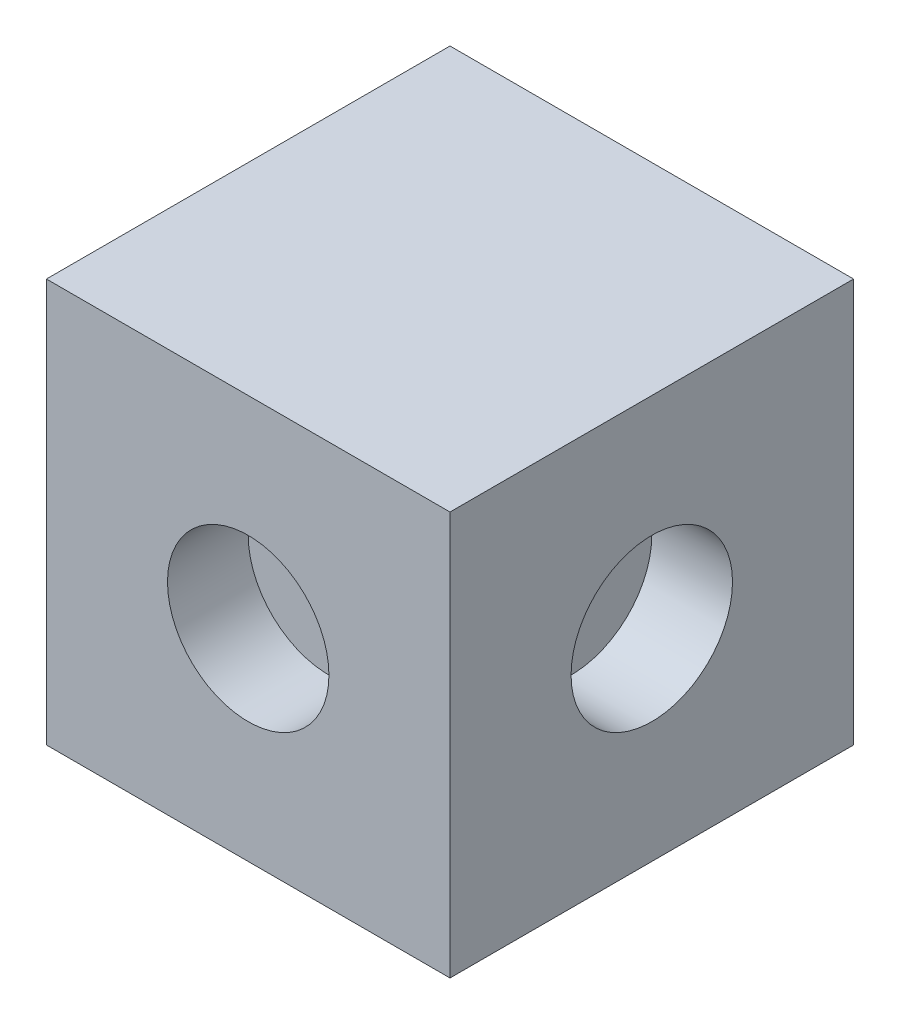
ISO-10303-21;
HEADER;
FILE_DESCRIPTION(('STEP AP214'),'2;1');
FILE_NAME('part.step','',(''),(''),'','','');
FILE_SCHEMA(('AUTOMOTIVE_DESIGN { 1 0 10303 214 1 1 1 1 }'));
ENDSEC;
DATA;
#1=APPLICATION_CONTEXT('core data for automotive mechanical design processes');
#2=APPLICATION_PROTOCOL_DEFINITION('international standard','automotive_design',2000,#1);
#3=PRODUCT_CONTEXT('',#1,'mechanical');
#4=PRODUCT('Part','Part','',(#3));
#5=PRODUCT_RELATED_PRODUCT_CATEGORY('part','',(#4));
#6=PRODUCT_DEFINITION_FORMATION('','',#4);
#7=PRODUCT_DEFINITION_CONTEXT('part definition',#1,'design');
#8=PRODUCT_DEFINITION('design','',#6,#7);
#9=PRODUCT_DEFINITION_SHAPE('','',#8);
#10=(LENGTH_UNIT() NAMED_UNIT(*) SI_UNIT(.MILLI.,.METRE.));
#11=(NAMED_UNIT(*) PLANE_ANGLE_UNIT() SI_UNIT($,.RADIAN.));
#12=(NAMED_UNIT(*) SI_UNIT($,.STERADIAN.) SOLID_ANGLE_UNIT());
#13=UNCERTAINTY_MEASURE_WITH_UNIT(LENGTH_MEASURE(1.E-05),#10,'distance_accuracy_value','');
#14=(GEOMETRIC_REPRESENTATION_CONTEXT(3) GLOBAL_UNCERTAINTY_ASSIGNED_CONTEXT((#13)) GLOBAL_UNIT_ASSIGNED_CONTEXT((#10,
#11,#12)) REPRESENTATION_CONTEXT('',''));
#15=CARTESIAN_POINT('',(0.,0.,0.));
#16=DIRECTION('',(0.,0.,1.));
#17=DIRECTION('',(1.,0.,0.));
#18=AXIS2_PLACEMENT_3D('',#15,#16,#17);
#19=CARTESIAN_POINT('',(25.,-25.,-25.));
#20=DIRECTION('',(0.,0.,1.));
#21=DIRECTION('',(1.,0.,0.));
#22=AXIS2_PLACEMENT_3D('',#19,#20,#21);
#23=PLANE('',#22);
#24=DIRECTION('',(0.,1.,0.));
#25=VECTOR('',#24,1.);
#26=CARTESIAN_POINT('',(-25.,-25.,-25.));
#27=LINE('',#26,#25);
#28=CARTESIAN_POINT('',(-25.,-25.,-25.));
#29=VERTEX_POINT('',#28);
#30=CARTESIAN_POINT('',(-25.,25.,-25.));
#31=VERTEX_POINT('',#30);
#32=EDGE_CURVE('E96',#29,#31,#27,.T.);
#33=ORIENTED_EDGE('',*,*,#32,.T.);
#34=DIRECTION('',(-1.,0.,0.));
#35=VECTOR('',#34,1.);
#36=CARTESIAN_POINT('',(25.,25.,-25.));
#37=LINE('',#36,#35);
#38=CARTESIAN_POINT('',(25.,25.,-25.));
#39=VERTEX_POINT('',#38);
#40=EDGE_CURVE('E11',#39,#31,#37,.T.);
#41=ORIENTED_EDGE('',*,*,#40,.F.);
#42=DIRECTION('',(0.,1.,0.));
#43=VECTOR('',#42,1.);
#44=CARTESIAN_POINT('',(25.,-25.,-25.));
#45=LINE('',#44,#43);
#46=CARTESIAN_POINT('',(25.,-25.,-25.));
#47=VERTEX_POINT('',#46);
#48=EDGE_CURVE('E84',#47,#39,#45,.T.);
#49=ORIENTED_EDGE('',*,*,#48,.F.);
#50=DIRECTION('',(-1.,0.,0.));
#51=VECTOR('',#50,1.);
#52=CARTESIAN_POINT('',(25.,-25.,-25.));
#53=LINE('',#52,#51);
#54=EDGE_CURVE('E92',#47,#29,#53,.T.);
#55=ORIENTED_EDGE('',*,*,#54,.T.);
#56=EDGE_LOOP('',(#33,#41,#49,#55));
#57=FACE_BOUND('',#56,.T.);
#58=CARTESIAN_POINT('',(0.,0.,-25.));
#59=DIRECTION('',(0.,0.,1.));
#60=DIRECTION('',(1.,0.,0.));
#61=AXIS2_PLACEMENT_3D('',#58,#59,#60);
#62=CIRCLE('',#61,10.);
#63=CARTESIAN_POINT('',(10.,0.,-25.));
#64=VERTEX_POINT('',#63);
#65=EDGE_CURVE('E130',#64,#64,#62,.T.);
#66=ORIENTED_EDGE('',*,*,#65,.T.);
#67=EDGE_LOOP('',(#66));
#68=FACE_BOUND('',#67,.T.);
#69=ADVANCED_FACE('F33',(#57,#68),#23,.F.);
#70=CARTESIAN_POINT('',(-25.,0.,0.));
#71=DIRECTION('',(-1.,0.,0.));
#72=DIRECTION('',(0.,0.,1.));
#73=AXIS2_PLACEMENT_3D('',#70,#71,#72);
#74=PLANE('',#73);
#75=ORIENTED_EDGE('',*,*,#32,.F.);
#76=DIRECTION('',(0.,0.,-1.));
#77=VECTOR('',#76,1.);
#78=CARTESIAN_POINT('',(-25.,-25.,25.));
#79=LINE('',#78,#77);
#80=CARTESIAN_POINT('',(-25.,-25.,25.));
#81=VERTEX_POINT('',#80);
#82=EDGE_CURVE('E72',#81,#29,#79,.T.);
#83=ORIENTED_EDGE('',*,*,#82,.F.);
#84=DIRECTION('',(0.,-1.,0.));
#85=VECTOR('',#84,1.);
#86=CARTESIAN_POINT('',(-25.,-25.,25.));
#87=LINE('',#86,#85);
#88=CARTESIAN_POINT('',(-25.,25.,25.));
#89=VERTEX_POINT('',#88);
#90=EDGE_CURVE('E66',#89,#81,#87,.T.);
#91=ORIENTED_EDGE('',*,*,#90,.F.);
#92=DIRECTION('',(0.,0.,1.));
#93=VECTOR('',#92,1.);
#94=CARTESIAN_POINT('',(-25.,25.,25.));
#95=LINE('',#94,#93);
#96=EDGE_CURVE('E88',#31,#89,#95,.T.);
#97=ORIENTED_EDGE('',*,*,#96,.F.);
#98=EDGE_LOOP('',(#75,#83,#91,#97));
#99=FACE_BOUND('',#98,.T.);
#100=CARTESIAN_POINT('',(-25.,0.,0.));
#101=DIRECTION('',(1.,0.,0.));
#102=DIRECTION('',(0.,0.,-1.));
#103=AXIS2_PLACEMENT_3D('',#100,#101,#102);
#104=CIRCLE('',#103,10.);
#105=CARTESIAN_POINT('',(-25.,0.,-10.));
#106=VERTEX_POINT('',#105);
#107=EDGE_CURVE('E118',#106,#106,#104,.T.);
#108=ORIENTED_EDGE('',*,*,#107,.T.);
#109=EDGE_LOOP('',(#108));
#110=FACE_BOUND('',#109,.T.);
#111=ADVANCED_FACE('F107',(#99,#110),#74,.T.);
#112=CARTESIAN_POINT('',(25.,25.,25.));
#113=DIRECTION('',(0.,-1.,0.));
#114=DIRECTION('',(0.,0.,-1.));
#115=AXIS2_PLACEMENT_3D('',#112,#113,#114);
#116=PLANE('',#115);
#117=ORIENTED_EDGE('',*,*,#96,.T.);
#118=DIRECTION('',(-1.,0.,0.));
#119=VECTOR('',#118,1.);
#120=CARTESIAN_POINT('',(25.,25.,25.));
#121=LINE('',#120,#119);
#122=CARTESIAN_POINT('',(25.,25.,25.));
#123=VERTEX_POINT('',#122);
#124=EDGE_CURVE('E41',#123,#89,#121,.T.);
#125=ORIENTED_EDGE('',*,*,#124,.F.);
#126=DIRECTION('',(0.,0.,1.));
#127=VECTOR('',#126,1.);
#128=CARTESIAN_POINT('',(25.,25.,25.));
#129=LINE('',#128,#127);
#130=EDGE_CURVE('E79',#39,#123,#129,.T.);
#131=ORIENTED_EDGE('',*,*,#130,.F.);
#132=ORIENTED_EDGE('',*,*,#40,.T.);
#133=EDGE_LOOP('',(#117,#125,#131,#132));
#134=FACE_BOUND('',#133,.T.);
#135=ADVANCED_FACE('F87',(#134),#116,.F.);
#136=CARTESIAN_POINT('',(25.,-25.,25.));
#137=DIRECTION('',(0.,0.,-1.));
#138=DIRECTION('',(-1.,0.,0.));
#139=AXIS2_PLACEMENT_3D('',#136,#137,#138);
#140=PLANE('',#139);
#141=CARTESIAN_POINT('',(0.,0.,25.));
#142=DIRECTION('',(0.,0.,1.));
#143=DIRECTION('',(1.,0.,0.));
#144=AXIS2_PLACEMENT_3D('',#141,#142,#143);
#145=CIRCLE('',#144,10.);
#146=CARTESIAN_POINT('',(10.,0.,25.));
#147=VERTEX_POINT('',#146);
#148=EDGE_CURVE('E124',#147,#147,#145,.T.);
#149=ORIENTED_EDGE('',*,*,#148,.F.);
#150=EDGE_LOOP('',(#149));
#151=FACE_BOUND('',#150,.T.);
#152=ORIENTED_EDGE('',*,*,#90,.T.);
#153=DIRECTION('',(-1.,0.,0.));
#154=VECTOR('',#153,1.);
#155=CARTESIAN_POINT('',(25.,-25.,25.));
#156=LINE('',#155,#154);
#157=CARTESIAN_POINT('',(25.,-25.,25.));
#158=VERTEX_POINT('',#157);
#159=EDGE_CURVE('E89',#158,#81,#156,.T.);
#160=ORIENTED_EDGE('',*,*,#159,.F.);
#161=DIRECTION('',(0.,-1.,0.));
#162=VECTOR('',#161,1.);
#163=CARTESIAN_POINT('',(25.,-25.,25.));
#164=LINE('',#163,#162);
#165=EDGE_CURVE('E82',#123,#158,#164,.T.);
#166=ORIENTED_EDGE('',*,*,#165,.F.);
#167=ORIENTED_EDGE('',*,*,#124,.T.);
#168=EDGE_LOOP('',(#152,#160,#166,#167));
#169=FACE_BOUND('',#168,.T.);
#170=ADVANCED_FACE('F90',(#151,#169),#140,.F.);
#171=CARTESIAN_POINT('',(25.,-25.,25.));
#172=DIRECTION('',(0.,1.,0.));
#173=DIRECTION('',(0.,0.,1.));
#174=AXIS2_PLACEMENT_3D('',#171,#172,#173);
#175=PLANE('',#174);
#176=ORIENTED_EDGE('',*,*,#82,.T.);
#177=ORIENTED_EDGE('',*,*,#54,.F.);
#178=DIRECTION('',(0.,0.,-1.));
#179=VECTOR('',#178,1.);
#180=CARTESIAN_POINT('',(25.,-25.,25.));
#181=LINE('',#180,#179);
#182=EDGE_CURVE('E49',#158,#47,#181,.T.);
#183=ORIENTED_EDGE('',*,*,#182,.F.);
#184=ORIENTED_EDGE('',*,*,#159,.T.);
#185=EDGE_LOOP('',(#176,#177,#183,#184));
#186=FACE_BOUND('',#185,.T.);
#187=ADVANCED_FACE('F104',(#186),#175,.F.);
#188=CARTESIAN_POINT('',(25.,0.,0.));
#189=DIRECTION('',(-1.,0.,0.));
#190=DIRECTION('',(0.,0.,1.));
#191=AXIS2_PLACEMENT_3D('',#188,#189,#190);
#192=PLANE('',#191);
#193=CARTESIAN_POINT('',(25.,0.,0.));
#194=DIRECTION('',(1.,0.,0.));
#195=DIRECTION('',(0.,0.,-1.));
#196=AXIS2_PLACEMENT_3D('',#193,#194,#195);
#197=CIRCLE('',#196,10.);
#198=CARTESIAN_POINT('',(25.,0.,-10.));
#199=VERTEX_POINT('',#198);
#200=EDGE_CURVE('E112',#199,#199,#197,.T.);
#201=ORIENTED_EDGE('',*,*,#200,.F.);
#202=EDGE_LOOP('',(#201));
#203=FACE_BOUND('',#202,.T.);
#204=ORIENTED_EDGE('',*,*,#48,.T.);
#205=ORIENTED_EDGE('',*,*,#130,.T.);
#206=ORIENTED_EDGE('',*,*,#165,.T.);
#207=ORIENTED_EDGE('',*,*,#182,.T.);
#208=EDGE_LOOP('',(#204,#205,#206,#207));
#209=FACE_BOUND('',#208,.T.);
#210=ADVANCED_FACE('F80',(#203,#209),#192,.F.);
#211=CARTESIAN_POINT('',(15.,0.,0.));
#212=DIRECTION('',(1.,0.,0.));
#213=DIRECTION('',(0.,0.,-1.));
#214=AXIS2_PLACEMENT_3D('',#211,#212,#213);
#215=CYLINDRICAL_SURFACE('',#214,10.);
#216=CARTESIAN_POINT('',(15.,0.,0.));
#217=DIRECTION('',(1.,0.,0.));
#218=DIRECTION('',(0.,0.,-1.));
#219=AXIS2_PLACEMENT_3D('',#216,#217,#218);
#220=CIRCLE('',#219,10.);
#221=CARTESIAN_POINT('',(15.,0.,-10.));
#222=VERTEX_POINT('',#221);
#223=EDGE_CURVE('E99',#222,#222,#220,.T.);
#224=ORIENTED_EDGE('',*,*,#223,.F.);
#225=EDGE_LOOP('',(#224));
#226=FACE_BOUND('',#225,.T.);
#227=ORIENTED_EDGE('',*,*,#200,.T.);
#228=EDGE_LOOP('',(#227));
#229=FACE_BOUND('',#228,.T.);
#230=ADVANCED_FACE('F187',(#226,#229),#215,.F.);
#231=CARTESIAN_POINT('',(15.,0.,0.));
#232=DIRECTION('',(1.,0.,0.));
#233=DIRECTION('',(0.,0.,-1.));
#234=AXIS2_PLACEMENT_3D('',#231,#232,#233);
#235=PLANE('',#234);
#236=ORIENTED_EDGE('',*,*,#223,.T.);
#237=EDGE_LOOP('',(#236));
#238=FACE_BOUND('',#237,.T.);
#239=ADVANCED_FACE('F184',(#238),#235,.T.);
#240=CARTESIAN_POINT('',(-15.,0.,0.));
#241=DIRECTION('',(-1.,0.,0.));
#242=DIRECTION('',(0.,0.,1.));
#243=AXIS2_PLACEMENT_3D('',#240,#241,#242);
#244=CYLINDRICAL_SURFACE('',#243,10.);
#245=CARTESIAN_POINT('',(-15.,0.,0.));
#246=DIRECTION('',(1.,0.,0.));
#247=DIRECTION('',(0.,0.,-1.));
#248=AXIS2_PLACEMENT_3D('',#245,#246,#247);
#249=CIRCLE('',#248,10.);
#250=CARTESIAN_POINT('',(-15.,0.,-10.));
#251=VERTEX_POINT('',#250);
#252=EDGE_CURVE('E115',#251,#251,#249,.T.);
#253=ORIENTED_EDGE('',*,*,#252,.T.);
#254=EDGE_LOOP('',(#253));
#255=FACE_BOUND('',#254,.T.);
#256=ORIENTED_EDGE('',*,*,#107,.F.);
#257=EDGE_LOOP('',(#256));
#258=FACE_BOUND('',#257,.T.);
#259=ADVANCED_FACE('F177',(#255,#258),#244,.F.);
#260=CARTESIAN_POINT('',(-15.,0.,0.));
#261=DIRECTION('',(-1.,0.,0.));
#262=DIRECTION('',(0.,0.,-1.));
#263=AXIS2_PLACEMENT_3D('',#260,#261,#262);
#264=PLANE('',#263);
#265=ORIENTED_EDGE('',*,*,#252,.F.);
#266=EDGE_LOOP('',(#265));
#267=FACE_BOUND('',#266,.T.);
#268=ADVANCED_FACE('F168',(#267),#264,.T.);
#269=CARTESIAN_POINT('',(0.,0.,15.));
#270=DIRECTION('',(0.,0.,1.));
#271=DIRECTION('',(1.,0.,0.));
#272=AXIS2_PLACEMENT_3D('',#269,#270,#271);
#273=CYLINDRICAL_SURFACE('',#272,10.);
#274=CARTESIAN_POINT('',(0.,0.,15.));
#275=DIRECTION('',(0.,0.,1.));
#276=DIRECTION('',(1.,0.,0.));
#277=AXIS2_PLACEMENT_3D('',#274,#275,#276);
#278=CIRCLE('',#277,10.);
#279=CARTESIAN_POINT('',(10.,0.,15.));
#280=VERTEX_POINT('',#279);
#281=EDGE_CURVE('E121',#280,#280,#278,.T.);
#282=ORIENTED_EDGE('',*,*,#281,.F.);
#283=EDGE_LOOP('',(#282));
#284=FACE_BOUND('',#283,.T.);
#285=ORIENTED_EDGE('',*,*,#148,.T.);
#286=EDGE_LOOP('',(#285));
#287=FACE_BOUND('',#286,.T.);
#288=ADVANCED_FACE('F166',(#284,#287),#273,.F.);
#289=CARTESIAN_POINT('',(0.,0.,15.));
#290=DIRECTION('',(0.,0.,1.));
#291=DIRECTION('',(1.,0.,0.));
#292=AXIS2_PLACEMENT_3D('',#289,#290,#291);
#293=PLANE('',#292);
#294=ORIENTED_EDGE('',*,*,#281,.T.);
#295=EDGE_LOOP('',(#294));
#296=FACE_BOUND('',#295,.T.);
#297=ADVANCED_FACE('F145',(#296),#293,.T.);
#298=CARTESIAN_POINT('',(0.,0.,-15.));
#299=DIRECTION('',(0.,0.,-1.));
#300=DIRECTION('',(-1.,0.,0.));
#301=AXIS2_PLACEMENT_3D('',#298,#299,#300);
#302=CYLINDRICAL_SURFACE('',#301,10.);
#303=CARTESIAN_POINT('',(0.,0.,-15.));
#304=DIRECTION('',(0.,0.,1.));
#305=DIRECTION('',(1.,0.,0.));
#306=AXIS2_PLACEMENT_3D('',#303,#304,#305);
#307=CIRCLE('',#306,10.);
#308=CARTESIAN_POINT('',(10.,0.,-15.));
#309=VERTEX_POINT('',#308);
#310=EDGE_CURVE('E127',#309,#309,#307,.T.);
#311=ORIENTED_EDGE('',*,*,#310,.T.);
#312=EDGE_LOOP('',(#311));
#313=FACE_BOUND('',#312,.T.);
#314=ORIENTED_EDGE('',*,*,#65,.F.);
#315=EDGE_LOOP('',(#314));
#316=FACE_BOUND('',#315,.T.);
#317=ADVANCED_FACE('F136',(#313,#316),#302,.F.);
#318=CARTESIAN_POINT('',(0.,0.,-15.));
#319=DIRECTION('',(0.,0.,-1.));
#320=DIRECTION('',(1.,0.,0.));
#321=AXIS2_PLACEMENT_3D('',#318,#319,#320);
#322=PLANE('',#321);
#323=ORIENTED_EDGE('',*,*,#310,.F.);
#324=EDGE_LOOP('',(#323));
#325=FACE_BOUND('',#324,.T.);
#326=ADVANCED_FACE('F139',(#325),#322,.T.);
#327=CLOSED_SHELL('',(#69,#111,#135,#170,#187,#210,#230,#239,#259,#268,#288,#297,#317,#326));
#328=MANIFOLD_SOLID_BREP('B2',#327);
#329=ADVANCED_BREP_SHAPE_REPRESENTATION('',(#18,#328),#14);
#330=SHAPE_DEFINITION_REPRESENTATION(#9,#329);
ENDSEC;
END-ISO-10303-21;
